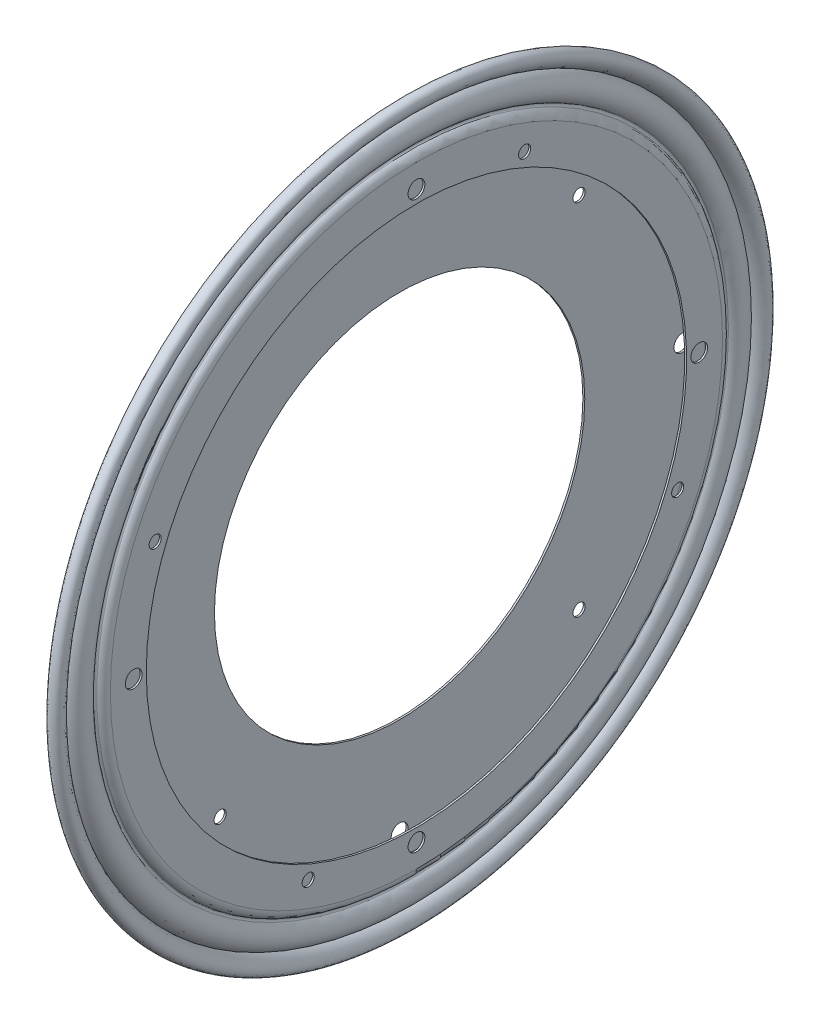
ISO-10303-21;
HEADER;
FILE_DESCRIPTION(('STEP AP214'),'2;1');
FILE_NAME('part.step','',(''),(''),'','','');
FILE_SCHEMA(('AUTOMOTIVE_DESIGN { 1 0 10303 214 1 1 1 1 }'));
ENDSEC;
DATA;
#1=APPLICATION_CONTEXT('core data for automotive mechanical design processes');
#2=APPLICATION_PROTOCOL_DEFINITION('international standard','automotive_design',2000,#1);
#3=PRODUCT_CONTEXT('',#1,'mechanical');
#4=PRODUCT('Part','Part','',(#3));
#5=PRODUCT_RELATED_PRODUCT_CATEGORY('part','',(#4));
#6=PRODUCT_DEFINITION_FORMATION('','',#4);
#7=PRODUCT_DEFINITION_CONTEXT('part definition',#1,'design');
#8=PRODUCT_DEFINITION('design','',#6,#7);
#9=PRODUCT_DEFINITION_SHAPE('','',#8);
#10=(LENGTH_UNIT() NAMED_UNIT(*) SI_UNIT(.MILLI.,.METRE.));
#11=(NAMED_UNIT(*) PLANE_ANGLE_UNIT() SI_UNIT($,.RADIAN.));
#12=(NAMED_UNIT(*) SI_UNIT($,.STERADIAN.) SOLID_ANGLE_UNIT());
#13=UNCERTAINTY_MEASURE_WITH_UNIT(LENGTH_MEASURE(1.E-05),#10,'distance_accuracy_value','');
#14=(GEOMETRIC_REPRESENTATION_CONTEXT(3) GLOBAL_UNCERTAINTY_ASSIGNED_CONTEXT((#13)) GLOBAL_UNIT_ASSIGNED_CONTEXT((#10,
#11,#12)) REPRESENTATION_CONTEXT('',''));
#15=CARTESIAN_POINT('',(0.,0.,0.));
#16=DIRECTION('',(0.,0.,1.));
#17=DIRECTION('',(1.,0.,0.));
#18=AXIS2_PLACEMENT_3D('',#15,#16,#17);
#19=CARTESIAN_POINT('',(-20.7806787586344,-125.372182842589,0.));
#20=DIRECTION('',(1.,0.,0.));
#21=DIRECTION('',(0.,0.,-1.));
#22=AXIS2_PLACEMENT_3D('',#19,#20,#21);
#23=TOROIDAL_SURFACE('',#22,156.907666903698,11.0071865304163);
#24=CARTESIAN_POINT('',(-17.3549548931554,-125.372182842589,0.));
#25=DIRECTION('',(1.,0.,0.));
#26=DIRECTION('',(0.,0.,-1.));
#27=AXIS2_PLACEMENT_3D('',#24,#25,#26);
#28=CIRCLE('',#27,146.447142475503);
#29=CARTESIAN_POINT('',(-17.3549548931554,-125.372182842589,-146.447142475503));
#30=VERTEX_POINT('',#29);
#31=EDGE_CURVE('P0_E11',#30,#30,#28,.T.);
#32=ORIENTED_EDGE('',*,*,#31,.T.);
#33=EDGE_LOOP('',(#32));
#34=FACE_BOUND('',#33,.T.);
#35=CARTESIAN_POINT('',(-17.9016694019906,-125.372182842589,0.));
#36=DIRECTION('',(1.,0.,0.));
#37=DIRECTION('',(0.,0.,-1.));
#38=AXIS2_PLACEMENT_3D('',#35,#36,#37);
#39=CIRCLE('',#38,146.28366292969);
#40=CARTESIAN_POINT('',(-17.9016694019906,-125.372182842589,-146.28366292969));
#41=VERTEX_POINT('',#40);
#42=EDGE_CURVE('P0_E45',#41,#41,#39,.T.);
#43=ORIENTED_EDGE('',*,*,#42,.F.);
#44=EDGE_LOOP('',(#43));
#45=FACE_BOUND('',#44,.T.);
#46=ADVANCED_FACE('P0_F35',(#34,#45),#23,.T.);
#47=CARTESIAN_POINT('',(-17.3549548931554,21.0749596329145,0.));
#48=CARTESIAN_POINT('',(-13.8843389422062,22.21155388043,0.));
#49=CARTESIAN_POINT('',(-13.3298945987826,26.395115924312,0.));
#50=CARTESIAN_POINT('',(-17.2144731093381,27.5448446665488,0.));
#51=CARTESIAN_POINT('',(-17.9016694019901,24.8783484462321,0.));
#52=CARTESIAN_POINT('',(-17.9016694019906,21.801683813341,0.));
#53=B_SPLINE_CURVE_WITH_KNOTS('',3,(#47,#48,#49,#50,#51,#52),.UNSPECIFIED.,.F.,.F.,(4,2,4),(0.,
0.5,1.),.UNSPECIFIED.);
#54=CARTESIAN_POINT('',(-17.9281580617092,-125.372182842589,0.));
#55=DIRECTION('',(1.,0.,0.));
#56=AXIS1_PLACEMENT('',#54,#55);
#57=SURFACE_OF_REVOLUTION('',#53,#56);
#58=CARTESIAN_POINT('',(-17.9016694019906,-125.372182842589,0.));
#59=DIRECTION('',(1.,0.,0.));
#60=DIRECTION('',(0.,0.,-1.));
#61=AXIS2_PLACEMENT_3D('',#58,#59,#60);
#62=CIRCLE('',#61,147.17386665593);
#63=CARTESIAN_POINT('',(-17.9016694019906,-125.372182842589,-147.17386665593));
#64=VERTEX_POINT('',#63);
#65=EDGE_CURVE('P0_E41',#64,#64,#62,.T.);
#66=ORIENTED_EDGE('',*,*,#65,.T.);
#67=EDGE_LOOP('',(#66));
#68=FACE_BOUND('',#67,.T.);
#69=ORIENTED_EDGE('',*,*,#31,.F.);
#70=EDGE_LOOP('',(#69));
#71=FACE_BOUND('',#70,.T.);
#72=ADVANCED_FACE('P0_F57',(#68,#71),#57,.F.);
#73=CARTESIAN_POINT('',(-17.9016694019906,21.8016838133411,0.));
#74=DIRECTION('',(-1.,0.,0.));
#75=DIRECTION('',(0.,0.,1.));
#76=AXIS2_PLACEMENT_3D('',#73,#74,#75);
#77=PLANE('',#76);
#78=ORIENTED_EDGE('',*,*,#42,.T.);
#79=EDGE_LOOP('',(#78));
#80=FACE_BOUND('',#79,.T.);
#81=ORIENTED_EDGE('',*,*,#65,.F.);
#82=EDGE_LOOP('',(#81));
#83=FACE_BOUND('',#82,.T.);
#84=ADVANCED_FACE('P0_F60',(#80,#83),#77,.T.);
#85=CLOSED_SHELL('',(#46,#72,#84));
#86=MANIFOLD_SOLID_BREP('P0_B2',#85);
#87=CARTESIAN_POINT('',(-19.3100196612605,-125.372182842589,0.));
#88=DIRECTION('',(1.,0.,0.));
#89=DIRECTION('',(0.,0.,-1.));
#90=AXIS2_PLACEMENT_3D('',#87,#88,#89);
#91=TOROIDAL_SURFACE('',#90,139.921456642182,6.17720025927117);
#92=CARTESIAN_POINT('',(-17.1079194019906,-125.372182842589,0.));
#93=DIRECTION('',(1.,0.,0.));
#94=DIRECTION('',(0.,1.,0.));
#95=AXIS2_PLACEMENT_3D('',#92,#93,#94);
#96=CIRCLE('',#95,145.692813284364);
#97=CARTESIAN_POINT('',(-17.1079194019906,20.3206304417751,0.));
#98=VERTEX_POINT('',#97);
#99=EDGE_CURVE('P1_E230',#98,#98,#96,.F.);
#100=ORIENTED_EDGE('',*,*,#99,.F.);
#101=EDGE_LOOP('',(#100));
#102=FACE_BOUND('',#101,.T.);
#103=CARTESIAN_POINT('',(-15.4837879251125,-125.372182842589,-4.20150754758772E-13));
#104=DIRECTION('',(1.,0.,0.));
#105=DIRECTION('',(0.,0.,-1.));
#106=AXIS2_PLACEMENT_3D('',#103,#104,#105);
#107=CIRCLE('',#106,135.071945971564);
#108=CARTESIAN_POINT('',(-15.4837879251127,-125.372182842589,-135.071945971565));
#109=VERTEX_POINT('',#108);
#110=EDGE_CURVE('P1_E222',#109,#109,#107,.T.);
#111=ORIENTED_EDGE('',*,*,#110,.F.);
#112=EDGE_LOOP('',(#111));
#113=FACE_BOUND('',#112,.T.);
#114=ADVANCED_FACE('P1_F19',(#102,#113),#91,.T.);
#115=CARTESIAN_POINT('',(-17.1079194019906,20.3206304417751,0.));
#116=CARTESIAN_POINT('',(-13.5609688594263,21.482223370196,0.));
#117=CARTESIAN_POINT('',(-10.2594893705851,27.359305232152,0.));
#118=CARTESIAN_POINT('',(-18.2673052500497,29.8151081640794,0.));
#119=CARTESIAN_POINT('',(-18.8073835861624,24.9252482589153,0.));
#120=CARTESIAN_POINT('',(-18.6954194019905,22.9101467016862,0.));
#121=CARTESIAN_POINT('',(-18.6954194019905,21.801683813341,0.));
#122=(BOUNDED_CURVE() B_SPLINE_CURVE(4,(#115,#116,#117,#118,#119,#120,#121),.UNSPECIFIED.,.F.,
.F.) B_SPLINE_CURVE_WITH_KNOTS((5,1,1,5),(0.,0.579146005992486,0.752139110939153,1.),
.UNSPECIFIED.) CURVE() GEOMETRIC_REPRESENTATION_ITEM() RATIONAL_B_SPLINE_CURVE((1.,1.,1.,1.,1.,
1.,1.)) REPRESENTATION_ITEM(''));
#123=CARTESIAN_POINT('',(-18.6954194019905,-125.372182842589,0.));
#124=DIRECTION('',(1.,0.,0.));
#125=AXIS1_PLACEMENT('',#123,#124);
#126=SURFACE_OF_REVOLUTION('',#122,#125);
#127=ORIENTED_EDGE('',*,*,#99,.T.);
#128=EDGE_LOOP('',(#127));
#129=FACE_BOUND('',#128,.T.);
#130=CARTESIAN_POINT('',(-18.6954194019905,-125.372182842589,0.));
#131=DIRECTION('',(1.,0.,0.));
#132=DIRECTION('',(0.,1.,0.));
#133=AXIS2_PLACEMENT_3D('',#130,#131,#132);
#134=CIRCLE('',#133,147.17386665593);
#135=CARTESIAN_POINT('',(-18.6954194019905,21.801683813341,0.));
#136=VERTEX_POINT('',#135);
#137=EDGE_CURVE('P1_E203',#136,#136,#134,.F.);
#138=ORIENTED_EDGE('',*,*,#137,.F.);
#139=EDGE_LOOP('',(#138));
#140=FACE_BOUND('',#139,.T.);
#141=ADVANCED_FACE('P1_F241',(#129,#140),#126,.F.);
#142=CARTESIAN_POINT('',(-14.9921296797761,-125.372182842589,-3.60822483003176E-13));
#143=DIRECTION('',(1.,0.,0.));
#144=DIRECTION('',(0.,0.,-1.));
#145=AXIS2_PLACEMENT_3D('',#142,#143,#144);
#146=TOROIDAL_SURFACE('',#145,134.448799734881,0.793749999999702);
#147=ORIENTED_EDGE('',*,*,#110,.T.);
#148=EDGE_LOOP('',(#147));
#149=FACE_BOUND('',#148,.T.);
#150=CARTESIAN_POINT('',(-15.344291750717,-125.372182842589,0.));
#151=DIRECTION('',(1.,0.,0.));
#152=DIRECTION('',(0.,0.,-1.));
#153=AXIS2_PLACEMENT_3D('',#150,#151,#152);
#154=CIRCLE('',#153,133.737448247717);
#155=CARTESIAN_POINT('',(-15.344291750717,-125.372182842589,-133.737448247717));
#156=VERTEX_POINT('',#155);
#157=EDGE_CURVE('P1_E200',#156,#156,#154,.T.);
#158=ORIENTED_EDGE('',*,*,#157,.F.);
#159=EDGE_LOOP('',(#158));
#160=FACE_BOUND('',#159,.T.);
#161=ADVANCED_FACE('P1_F245',(#149,#160),#146,.F.);
#162=CARTESIAN_POINT('',(-18.6954194019905,20.6145735626252,0.));
#163=DIRECTION('',(-1.,0.,0.));
#164=DIRECTION('',(0.,0.,1.));
#165=AXIS2_PLACEMENT_3D('',#162,#163,#164);
#166=PLANE('',#165);
#167=CARTESIAN_POINT('',(-18.6954194019905,-125.372182842589,0.));
#168=DIRECTION('',(1.,0.,0.));
#169=DIRECTION('',(0.,0.,-1.));
#170=AXIS2_PLACEMENT_3D('',#167,#168,#169);
#171=CIRCLE('',#170,144.799646154499);
#172=CARTESIAN_POINT('',(-18.6954194019905,-125.372182842589,-144.799646154499));
#173=VERTEX_POINT('',#172);
#174=EDGE_CURVE('P1_E23',#173,#173,#171,.F.);
#175=ORIENTED_EDGE('',*,*,#174,.F.);
#176=EDGE_LOOP('',(#175));
#177=FACE_BOUND('',#176,.T.);
#178=ORIENTED_EDGE('',*,*,#137,.T.);
#179=EDGE_LOOP('',(#178));
#180=FACE_BOUND('',#179,.T.);
#181=ADVANCED_FACE('P1_F193',(#177,#180),#166,.T.);
#182=CARTESIAN_POINT('',(-17.1079194019905,-125.372182842589,0.));
#183=DIRECTION('',(1.,0.,0.));
#184=DIRECTION('',(0.,0.,-1.));
#185=AXIS2_PLACEMENT_3D('',#182,#183,#184);
#186=TOROIDAL_SURFACE('',#185,130.175,3.9751);
#187=ORIENTED_EDGE('',*,*,#157,.T.);
#188=EDGE_LOOP('',(#187));
#189=FACE_BOUND('',#188,.T.);
#190=CARTESIAN_POINT('',(-13.1328194019905,-125.372182842589,0.));
#191=DIRECTION('',(-1.,0.,0.));
#192=DIRECTION('',(0.,1.,0.));
#193=AXIS2_PLACEMENT_3D('',#190,#191,#192);
#194=CIRCLE('',#193,130.175);
#195=CARTESIAN_POINT('',(-13.1328194019905,4.80281715741121,0.));
#196=VERTEX_POINT('',#195);
#197=EDGE_CURVE('P1_E149',#196,#196,#194,.F.);
#198=ORIENTED_EDGE('',*,*,#197,.F.);
#199=EDGE_LOOP('',(#198));
#200=FACE_BOUND('',#199,.T.);
#201=ADVANCED_FACE('P1_F188',(#189,#200),#186,.T.);
#202=CARTESIAN_POINT('',(-14.9058191427206,-125.372182842589,0.));
#203=DIRECTION('',(1.,0.,0.));
#204=DIRECTION('',(0.,0.,-1.));
#205=AXIS2_PLACEMENT_3D('',#202,#203,#204);
#206=TOROIDAL_SURFACE('',#205,139.921456642182,6.17720025927117);
#207=CARTESIAN_POINT('',(-18.7320508788683,-125.372182842589,-7.98234008933115E-13));
#208=DIRECTION('',(-1.,0.,0.));
#209=DIRECTION('',(0.,0.,1.));
#210=AXIS2_PLACEMENT_3D('',#207,#208,#209);
#211=CIRCLE('',#210,135.071945971565);
#212=CARTESIAN_POINT('',(-18.7320508788681,-125.372182842589,135.071945971564));
#213=VERTEX_POINT('',#212);
#214=EDGE_CURVE('P1_E145',#213,#213,#211,.T.);
#215=ORIENTED_EDGE('',*,*,#214,.F.);
#216=EDGE_LOOP('',(#215));
#217=FACE_BOUND('',#216,.T.);
#218=ORIENTED_EDGE('',*,*,#174,.T.);
#219=EDGE_LOOP('',(#218));
#220=FACE_BOUND('',#219,.T.);
#221=ADVANCED_FACE('P1_F182',(#217,#220),#206,.T.);
#222=CARTESIAN_POINT('',(-13.1328194019906,-60.2846828425888,0.));
#223=DIRECTION('',(1.,0.,0.));
#224=DIRECTION('',(0.,0.,-1.));
#225=AXIS2_PLACEMENT_3D('',#222,#223,#224);
#226=PLANE('',#225);
#227=CARTESIAN_POINT('',(-13.1328194019906,-125.372182842589,0.));
#228=DIRECTION('',(-1.,0.,0.));
#229=DIRECTION('',(0.,0.,1.));
#230=AXIS2_PLACEMENT_3D('',#227,#228,#229);
#231=CIRCLE('',#230,114.8969);
#232=CARTESIAN_POINT('',(-13.1328194019906,-125.372182842589,114.8969));
#233=VERTEX_POINT('',#232);
#234=EDGE_CURVE('P1_E120',#233,#233,#231,.T.);
#235=ORIENTED_EDGE('',*,*,#234,.T.);
#236=EDGE_LOOP('',(#235));
#237=FACE_BOUND('',#236,.T.);
#238=CARTESIAN_POINT('',(-13.1328194019906,-5.11588284258878,0.));
#239=DIRECTION('',(1.,0.,0.));
#240=DIRECTION('',(0.,0.,-1.));
#241=AXIS2_PLACEMENT_3D('',#238,#239,#240);
#242=CIRCLE('',#241,3.5687);
#243=CARTESIAN_POINT('',(-13.1328194019906,-5.11588284258878,-3.5687));
#244=VERTEX_POINT('',#243);
#245=EDGE_CURVE('P1_E123',#244,#244,#242,.F.);
#246=ORIENTED_EDGE('',*,*,#245,.T.);
#247=EDGE_LOOP('',(#246));
#248=FACE_BOUND('',#247,.T.);
#249=CARTESIAN_POINT('',(-13.1328194019906,-125.372182842589,-120.2563));
#250=DIRECTION('',(1.,0.,0.));
#251=DIRECTION('',(0.,0.,-1.));
#252=AXIS2_PLACEMENT_3D('',#249,#250,#251);
#253=CIRCLE('',#252,3.56869999999997);
#254=CARTESIAN_POINT('',(-13.1328194019906,-125.372182842589,-123.825));
#255=VERTEX_POINT('',#254);
#256=EDGE_CURVE('P1_E126',#255,#255,#253,.F.);
#257=ORIENTED_EDGE('',*,*,#256,.T.);
#258=EDGE_LOOP('',(#257));
#259=FACE_BOUND('',#258,.T.);
#260=CARTESIAN_POINT('',(-13.1328194019906,-245.628482842589,0.));
#261=DIRECTION('',(1.,0.,0.));
#262=DIRECTION('',(0.,0.,-1.));
#263=AXIS2_PLACEMENT_3D('',#260,#261,#262);
#264=CIRCLE('',#263,3.56870000000005);
#265=CARTESIAN_POINT('',(-13.1328194019906,-245.628482842589,-3.5687));
#266=VERTEX_POINT('',#265);
#267=EDGE_CURVE('P1_E129',#266,#266,#264,.F.);
#268=ORIENTED_EDGE('',*,*,#267,.T.);
#269=EDGE_LOOP('',(#268));
#270=FACE_BOUND('',#269,.T.);
#271=CARTESIAN_POINT('',(-13.1328194019906,-125.372182842589,120.2563));
#272=DIRECTION('',(1.,0.,0.));
#273=DIRECTION('',(0.,0.,-1.));
#274=AXIS2_PLACEMENT_3D('',#271,#272,#273);
#275=CIRCLE('',#274,3.56869999999992);
#276=CARTESIAN_POINT('',(-13.1328194019906,-125.372182842589,116.6876));
#277=VERTEX_POINT('',#276);
#278=EDGE_CURVE('P1_E132',#277,#277,#275,.F.);
#279=ORIENTED_EDGE('',*,*,#278,.T.);
#280=EDGE_LOOP('',(#279));
#281=FACE_BOUND('',#280,.T.);
#282=CARTESIAN_POINT('',(-13.1328194019906,-14.2698486170517,-46.0200936475259));
#283=DIRECTION('',(1.,0.,0.));
#284=DIRECTION('',(0.,0.,-1.));
#285=AXIS2_PLACEMENT_3D('',#282,#283,#284);
#286=CIRCLE('',#285,2.57809999999995);
#287=CARTESIAN_POINT('',(-13.1328194019906,-14.2698486170517,-48.5981936475259));
#288=VERTEX_POINT('',#287);
#289=EDGE_CURVE('P1_E135',#288,#288,#286,.F.);
#290=ORIENTED_EDGE('',*,*,#289,.T.);
#291=EDGE_LOOP('',(#290));
#292=FACE_BOUND('',#291,.T.);
#293=CARTESIAN_POINT('',(-13.1328194019906,-171.392276490115,-111.102334225537));
#294=DIRECTION('',(1.,0.,0.));
#295=DIRECTION('',(0.,0.,-1.));
#296=AXIS2_PLACEMENT_3D('',#293,#294,#295);
#297=CIRCLE('',#296,2.5781);
#298=CARTESIAN_POINT('',(-13.1328194019906,-171.392276490115,-113.680434225537));
#299=VERTEX_POINT('',#298);
#300=EDGE_CURVE('P1_E138',#299,#299,#297,.F.);
#301=ORIENTED_EDGE('',*,*,#300,.T.);
#302=EDGE_LOOP('',(#301));
#303=FACE_BOUND('',#302,.T.);
#304=CARTESIAN_POINT('',(-13.1328194019906,-236.474517068126,46.0200936475259));
#305=DIRECTION('',(1.,0.,0.));
#306=DIRECTION('',(0.,0.,-1.));
#307=AXIS2_PLACEMENT_3D('',#304,#305,#306);
#308=CIRCLE('',#307,2.57809999999995);
#309=CARTESIAN_POINT('',(-13.1328194019906,-236.474517068126,43.441993647526));
#310=VERTEX_POINT('',#309);
#311=EDGE_CURVE('P1_E141',#310,#310,#308,.F.);
#312=ORIENTED_EDGE('',*,*,#311,.T.);
#313=EDGE_LOOP('',(#312));
#314=FACE_BOUND('',#313,.T.);
#315=CARTESIAN_POINT('',(-13.1328194019906,-79.3520891950629,111.102334225537));
#316=DIRECTION('',(1.,0.,0.));
#317=DIRECTION('',(0.,0.,-1.));
#318=AXIS2_PLACEMENT_3D('',#315,#316,#317);
#319=CIRCLE('',#318,2.57810000000005);
#320=CARTESIAN_POINT('',(-13.1328194019906,-79.3520891950629,108.524234225537));
#321=VERTEX_POINT('',#320);
#322=EDGE_CURVE('P1_E143',#321,#321,#319,.F.);
#323=ORIENTED_EDGE('',*,*,#322,.T.);
#324=EDGE_LOOP('',(#323));
#325=FACE_BOUND('',#324,.T.);
#326=ORIENTED_EDGE('',*,*,#197,.T.);
#327=EDGE_LOOP('',(#326));
#328=FACE_BOUND('',#327,.T.);
#329=ADVANCED_FACE('P1_F171',(#237,#248,#259,#270,#281,#292,#303,#314,#325,#328),#226,.T.);
#330=CARTESIAN_POINT('',(-19.2237091242057,-125.372182842589,-8.04911692853238E-13));
#331=DIRECTION('',(1.,0.,0.));
#332=DIRECTION('',(0.,0.,-1.));
#333=AXIS2_PLACEMENT_3D('',#330,#331,#332);
#334=TOROIDAL_SURFACE('',#333,134.448799734881,0.793750000000423);
#335=CARTESIAN_POINT('',(-18.8715470532641,-125.372182842589,0.));
#336=DIRECTION('',(1.,0.,0.));
#337=DIRECTION('',(0.,0.,-1.));
#338=AXIS2_PLACEMENT_3D('',#335,#336,#337);
#339=CIRCLE('',#338,133.737448247717);
#340=CARTESIAN_POINT('',(-18.8715470532641,-125.372182842589,-133.737448247717));
#341=VERTEX_POINT('',#340);
#342=EDGE_CURVE('P1_E119',#341,#341,#339,.F.);
#343=ORIENTED_EDGE('',*,*,#342,.F.);
#344=EDGE_LOOP('',(#343));
#345=FACE_BOUND('',#344,.T.);
#346=ORIENTED_EDGE('',*,*,#214,.T.);
#347=EDGE_LOOP('',(#346));
#348=FACE_BOUND('',#347,.T.);
#349=ADVANCED_FACE('P1_F181',(#345,#348),#334,.F.);
#350=CARTESIAN_POINT('',(-13.5296944019906,-79.3520891950629,111.102334225537));
#351=DIRECTION('',(1.,0.,0.));
#352=DIRECTION('',(0.,0.,-1.));
#353=AXIS2_PLACEMENT_3D('',#350,#351,#352);
#354=CYLINDRICAL_SURFACE('',#353,2.57810000000005);
#355=CARTESIAN_POINT('',(-13.9265694019906,-79.3520891950629,111.102334225537));
#356=DIRECTION('',(1.,0.,0.));
#357=DIRECTION('',(0.,0.,-1.));
#358=AXIS2_PLACEMENT_3D('',#355,#356,#357);
#359=CIRCLE('',#358,2.57810000000005);
#360=CARTESIAN_POINT('',(-13.9265694019906,-79.3520891950629,108.524234225537));
#361=VERTEX_POINT('',#360);
#362=EDGE_CURVE('P1_E116',#361,#361,#359,.T.);
#363=ORIENTED_EDGE('',*,*,#362,.F.);
#364=EDGE_LOOP('',(#363));
#365=FACE_BOUND('',#364,.T.);
#366=ORIENTED_EDGE('',*,*,#322,.F.);
#367=EDGE_LOOP('',(#366));
#368=FACE_BOUND('',#367,.T.);
#369=ADVANCED_FACE('P1_F184',(#365,#368),#354,.F.);
#370=CARTESIAN_POINT('',(-13.5296944019906,-236.474517068126,46.0200936475259));
#371=DIRECTION('',(1.,0.,0.));
#372=DIRECTION('',(0.,0.,-1.));
#373=AXIS2_PLACEMENT_3D('',#370,#371,#372);
#374=CYLINDRICAL_SURFACE('',#373,2.57809999999995);
#375=CARTESIAN_POINT('',(-13.9265694019906,-236.474517068126,46.0200936475259));
#376=DIRECTION('',(1.,0.,0.));
#377=DIRECTION('',(0.,0.,-1.));
#378=AXIS2_PLACEMENT_3D('',#375,#376,#377);
#379=CIRCLE('',#378,2.57809999999995);
#380=CARTESIAN_POINT('',(-13.9265694019906,-236.474517068126,43.441993647526));
#381=VERTEX_POINT('',#380);
#382=EDGE_CURVE('P1_E113',#381,#381,#379,.T.);
#383=ORIENTED_EDGE('',*,*,#382,.F.);
#384=EDGE_LOOP('',(#383));
#385=FACE_BOUND('',#384,.T.);
#386=ORIENTED_EDGE('',*,*,#311,.F.);
#387=EDGE_LOOP('',(#386));
#388=FACE_BOUND('',#387,.T.);
#389=ADVANCED_FACE('P1_F266',(#385,#388),#374,.F.);
#390=CARTESIAN_POINT('',(-13.5296944019906,-171.392276490115,-111.102334225537));
#391=DIRECTION('',(1.,0.,0.));
#392=DIRECTION('',(0.,0.,-1.));
#393=AXIS2_PLACEMENT_3D('',#390,#391,#392);
#394=CYLINDRICAL_SURFACE('',#393,2.5781);
#395=CARTESIAN_POINT('',(-13.9265694019906,-171.392276490115,-111.102334225537));
#396=DIRECTION('',(1.,0.,0.));
#397=DIRECTION('',(0.,0.,-1.));
#398=AXIS2_PLACEMENT_3D('',#395,#396,#397);
#399=CIRCLE('',#398,2.5781);
#400=CARTESIAN_POINT('',(-13.9265694019906,-171.392276490115,-113.680434225537));
#401=VERTEX_POINT('',#400);
#402=EDGE_CURVE('P1_E110',#401,#401,#399,.T.);
#403=ORIENTED_EDGE('',*,*,#402,.F.);
#404=EDGE_LOOP('',(#403));
#405=FACE_BOUND('',#404,.T.);
#406=ORIENTED_EDGE('',*,*,#300,.F.);
#407=EDGE_LOOP('',(#406));
#408=FACE_BOUND('',#407,.T.);
#409=ADVANCED_FACE('P1_F360',(#405,#408),#394,.F.);
#410=CARTESIAN_POINT('',(-13.5296944019906,-14.2698486170517,-46.0200936475259));
#411=DIRECTION('',(1.,0.,0.));
#412=DIRECTION('',(0.,0.,-1.));
#413=AXIS2_PLACEMENT_3D('',#410,#411,#412);
#414=CYLINDRICAL_SURFACE('',#413,2.57809999999995);
#415=CARTESIAN_POINT('',(-13.9265694019906,-14.2698486170517,-46.0200936475259));
#416=DIRECTION('',(1.,0.,0.));
#417=DIRECTION('',(0.,0.,-1.));
#418=AXIS2_PLACEMENT_3D('',#415,#416,#417);
#419=CIRCLE('',#418,2.57809999999995);
#420=CARTESIAN_POINT('',(-13.9265694019906,-14.2698486170517,-48.5981936475259));
#421=VERTEX_POINT('',#420);
#422=EDGE_CURVE('P1_E107',#421,#421,#419,.T.);
#423=ORIENTED_EDGE('',*,*,#422,.F.);
#424=EDGE_LOOP('',(#423));
#425=FACE_BOUND('',#424,.T.);
#426=ORIENTED_EDGE('',*,*,#289,.F.);
#427=EDGE_LOOP('',(#426));
#428=FACE_BOUND('',#427,.T.);
#429=ADVANCED_FACE('P1_F356',(#425,#428),#414,.F.);
#430=CARTESIAN_POINT('',(-13.5296944019906,-125.372182842589,120.2563));
#431=DIRECTION('',(1.,0.,0.));
#432=DIRECTION('',(0.,0.,-1.));
#433=AXIS2_PLACEMENT_3D('',#430,#431,#432);
#434=CYLINDRICAL_SURFACE('',#433,3.56869999999992);
#435=CARTESIAN_POINT('',(-13.9265694019906,-125.372182842589,120.2563));
#436=DIRECTION('',(1.,0.,0.));
#437=DIRECTION('',(0.,0.,-1.));
#438=AXIS2_PLACEMENT_3D('',#435,#436,#437);
#439=CIRCLE('',#438,3.56869999999992);
#440=CARTESIAN_POINT('',(-13.9265694019906,-125.372182842589,116.6876));
#441=VERTEX_POINT('',#440);
#442=EDGE_CURVE('P1_E104',#441,#441,#439,.T.);
#443=ORIENTED_EDGE('',*,*,#442,.F.);
#444=EDGE_LOOP('',(#443));
#445=FACE_BOUND('',#444,.T.);
#446=ORIENTED_EDGE('',*,*,#278,.F.);
#447=EDGE_LOOP('',(#446));
#448=FACE_BOUND('',#447,.T.);
#449=ADVANCED_FACE('P1_F352',(#445,#448),#434,.F.);
#450=CARTESIAN_POINT('',(-13.5296944019906,-245.628482842589,0.));
#451=DIRECTION('',(1.,0.,0.));
#452=DIRECTION('',(0.,0.,-1.));
#453=AXIS2_PLACEMENT_3D('',#450,#451,#452);
#454=CYLINDRICAL_SURFACE('',#453,3.56870000000005);
#455=CARTESIAN_POINT('',(-13.9265694019906,-245.628482842589,0.));
#456=DIRECTION('',(1.,0.,0.));
#457=DIRECTION('',(0.,0.,-1.));
#458=AXIS2_PLACEMENT_3D('',#455,#456,#457);
#459=CIRCLE('',#458,3.56870000000005);
#460=CARTESIAN_POINT('',(-13.9265694019906,-245.628482842589,-3.5687));
#461=VERTEX_POINT('',#460);
#462=EDGE_CURVE('P1_E101',#461,#461,#459,.T.);
#463=ORIENTED_EDGE('',*,*,#462,.F.);
#464=EDGE_LOOP('',(#463));
#465=FACE_BOUND('',#464,.T.);
#466=ORIENTED_EDGE('',*,*,#267,.F.);
#467=EDGE_LOOP('',(#466));
#468=FACE_BOUND('',#467,.T.);
#469=ADVANCED_FACE('P1_F348',(#465,#468),#454,.F.);
#470=CARTESIAN_POINT('',(-13.5296944019906,-125.372182842589,-120.2563));
#471=DIRECTION('',(1.,0.,0.));
#472=DIRECTION('',(0.,0.,-1.));
#473=AXIS2_PLACEMENT_3D('',#470,#471,#472);
#474=CYLINDRICAL_SURFACE('',#473,3.56869999999997);
#475=CARTESIAN_POINT('',(-13.9265694019906,-125.372182842589,-120.2563));
#476=DIRECTION('',(1.,0.,0.));
#477=DIRECTION('',(0.,0.,-1.));
#478=AXIS2_PLACEMENT_3D('',#475,#476,#477);
#479=CIRCLE('',#478,3.56869999999997);
#480=CARTESIAN_POINT('',(-13.9265694019906,-125.372182842589,-123.825));
#481=VERTEX_POINT('',#480);
#482=EDGE_CURVE('P1_E98',#481,#481,#479,.T.);
#483=ORIENTED_EDGE('',*,*,#482,.F.);
#484=EDGE_LOOP('',(#483));
#485=FACE_BOUND('',#484,.T.);
#486=ORIENTED_EDGE('',*,*,#256,.F.);
#487=EDGE_LOOP('',(#486));
#488=FACE_BOUND('',#487,.T.);
#489=ADVANCED_FACE('P1_F344',(#485,#488),#474,.F.);
#490=CARTESIAN_POINT('',(-13.5296944019906,-5.11588284258878,0.));
#491=DIRECTION('',(1.,0.,0.));
#492=DIRECTION('',(0.,0.,-1.));
#493=AXIS2_PLACEMENT_3D('',#490,#491,#492);
#494=CYLINDRICAL_SURFACE('',#493,3.5687);
#495=CARTESIAN_POINT('',(-13.9265694019906,-5.11588284258878,0.));
#496=DIRECTION('',(1.,0.,0.));
#497=DIRECTION('',(0.,0.,-1.));
#498=AXIS2_PLACEMENT_3D('',#495,#496,#497);
#499=CIRCLE('',#498,3.5687);
#500=CARTESIAN_POINT('',(-13.9265694019906,-5.11588284258878,-3.5687));
#501=VERTEX_POINT('',#500);
#502=EDGE_CURVE('P1_E95',#501,#501,#499,.T.);
#503=ORIENTED_EDGE('',*,*,#502,.F.);
#504=EDGE_LOOP('',(#503));
#505=FACE_BOUND('',#504,.T.);
#506=ORIENTED_EDGE('',*,*,#245,.F.);
#507=EDGE_LOOP('',(#506));
#508=FACE_BOUND('',#507,.T.);
#509=ADVANCED_FACE('P1_F340',(#505,#508),#494,.F.);
#510=CARTESIAN_POINT('',(-13.1328194019906,-125.372182842589,0.));
#511=DIRECTION('',(-1.,0.,0.));
#512=DIRECTION('',(0.,0.,1.));
#513=AXIS2_PLACEMENT_3D('',#510,#511,#512);
#514=CYLINDRICAL_SURFACE('',#513,114.8969);
#515=CARTESIAN_POINT('',(-13.9265694019906,-125.372182842589,0.));
#516=DIRECTION('',(-1.,0.,0.));
#517=DIRECTION('',(0.,0.,1.));
#518=AXIS2_PLACEMENT_3D('',#515,#516,#517);
#519=CIRCLE('',#518,114.8969);
#520=CARTESIAN_POINT('',(-13.9265694019906,-125.372182842589,114.8969));
#521=VERTEX_POINT('',#520);
#522=EDGE_CURVE('P1_E92',#521,#521,#519,.F.);
#523=ORIENTED_EDGE('',*,*,#522,.F.);
#524=EDGE_LOOP('',(#523));
#525=FACE_BOUND('',#524,.T.);
#526=ORIENTED_EDGE('',*,*,#234,.F.);
#527=EDGE_LOOP('',(#526));
#528=FACE_BOUND('',#527,.T.);
#529=ADVANCED_FACE('P1_F336',(#525,#528),#514,.F.);
#530=CARTESIAN_POINT('',(-17.1079194019905,-125.372182842589,0.));
#531=DIRECTION('',(1.,0.,0.));
#532=DIRECTION('',(0.,0.,-1.));
#533=AXIS2_PLACEMENT_3D('',#530,#531,#532);
#534=TOROIDAL_SURFACE('',#533,130.175,3.97509999999998);
#535=CARTESIAN_POINT('',(-21.0830194019905,-125.372182842589,0.));
#536=DIRECTION('',(1.,0.,0.));
#537=DIRECTION('',(0.,1.,0.));
#538=AXIS2_PLACEMENT_3D('',#535,#536,#537);
#539=CIRCLE('',#538,130.175);
#540=CARTESIAN_POINT('',(-21.0830194019905,4.80281715741121,0.));
#541=VERTEX_POINT('',#540);
#542=EDGE_CURVE('P1_E91',#541,#541,#539,.F.);
#543=ORIENTED_EDGE('',*,*,#542,.F.);
#544=EDGE_LOOP('',(#543));
#545=FACE_BOUND('',#544,.T.);
#546=ORIENTED_EDGE('',*,*,#342,.T.);
#547=EDGE_LOOP('',(#546));
#548=FACE_BOUND('',#547,.T.);
#549=ADVANCED_FACE('P1_F332',(#545,#548),#534,.T.);
#550=CARTESIAN_POINT('',(-13.9265694019906,-60.2846828425888,0.));
#551=DIRECTION('',(-1.,0.,0.));
#552=DIRECTION('',(0.,0.,1.));
#553=AXIS2_PLACEMENT_3D('',#550,#551,#552);
#554=PLANE('',#553);
#555=ORIENTED_EDGE('',*,*,#522,.T.);
#556=EDGE_LOOP('',(#555));
#557=FACE_BOUND('',#556,.T.);
#558=ORIENTED_EDGE('',*,*,#502,.T.);
#559=EDGE_LOOP('',(#558));
#560=FACE_BOUND('',#559,.T.);
#561=ORIENTED_EDGE('',*,*,#482,.T.);
#562=EDGE_LOOP('',(#561));
#563=FACE_BOUND('',#562,.T.);
#564=ORIENTED_EDGE('',*,*,#462,.T.);
#565=EDGE_LOOP('',(#564));
#566=FACE_BOUND('',#565,.T.);
#567=ORIENTED_EDGE('',*,*,#442,.T.);
#568=EDGE_LOOP('',(#567));
#569=FACE_BOUND('',#568,.T.);
#570=ORIENTED_EDGE('',*,*,#422,.T.);
#571=EDGE_LOOP('',(#570));
#572=FACE_BOUND('',#571,.T.);
#573=ORIENTED_EDGE('',*,*,#402,.T.);
#574=EDGE_LOOP('',(#573));
#575=FACE_BOUND('',#574,.T.);
#576=ORIENTED_EDGE('',*,*,#382,.T.);
#577=EDGE_LOOP('',(#576));
#578=FACE_BOUND('',#577,.T.);
#579=ORIENTED_EDGE('',*,*,#362,.T.);
#580=EDGE_LOOP('',(#579));
#581=FACE_BOUND('',#580,.T.);
#582=CARTESIAN_POINT('',(-13.9265694019906,-125.372182842589,0.));
#583=DIRECTION('',(1.,0.,0.));
#584=DIRECTION('',(0.,0.,-1.));
#585=AXIS2_PLACEMENT_3D('',#582,#583,#584);
#586=CIRCLE('',#585,130.175);
#587=CARTESIAN_POINT('',(-13.9265694019903,-125.372182842589,-130.175));
#588=VERTEX_POINT('',#587);
#589=EDGE_CURVE('P1_E88',#588,#588,#586,.T.);
#590=ORIENTED_EDGE('',*,*,#589,.F.);
#591=EDGE_LOOP('',(#590));
#592=FACE_BOUND('',#591,.T.);
#593=ADVANCED_FACE('P1_F316',(#557,#560,#563,#566,#569,#572,#575,#578,#581,#592),#554,.T.);
#594=CARTESIAN_POINT('',(-21.0830194019906,-60.2846828425888,0.));
#595=DIRECTION('',(-1.,0.,0.));
#596=DIRECTION('',(0.,0.,1.));
#597=AXIS2_PLACEMENT_3D('',#594,#595,#596);
#598=PLANE('',#597);
#599=CARTESIAN_POINT('',(-21.0830194019906,-49.0400058135011,76.3321770290878));
#600=DIRECTION('',(1.,0.,0.));
#601=DIRECTION('',(0.,0.,-1.));
#602=AXIS2_PLACEMENT_3D('',#599,#600,#601);
#603=CIRCLE('',#602,2.5781);
#604=CARTESIAN_POINT('',(-21.0830194019906,-49.0400058135011,73.7540770290878));
#605=VERTEX_POINT('',#604);
#606=EDGE_CURVE('P1_E61',#605,#605,#603,.T.);
#607=ORIENTED_EDGE('',*,*,#606,.T.);
#608=EDGE_LOOP('',(#607));
#609=FACE_BOUND('',#608,.T.);
#610=CARTESIAN_POINT('',(-21.0830194019906,-201.704359871677,76.3321770290878));
#611=DIRECTION('',(1.,0.,0.));
#612=DIRECTION('',(0.,0.,-1.));
#613=AXIS2_PLACEMENT_3D('',#610,#611,#612);
#614=CIRCLE('',#613,2.5781);
#615=CARTESIAN_POINT('',(-21.0830194019906,-201.704359871677,73.7540770290878));
#616=VERTEX_POINT('',#615);
#617=EDGE_CURVE('P1_E64',#616,#616,#614,.T.);
#618=ORIENTED_EDGE('',*,*,#617,.T.);
#619=EDGE_LOOP('',(#618));
#620=FACE_BOUND('',#619,.T.);
#621=CARTESIAN_POINT('',(-21.0830194019906,-201.704359871677,-76.3321770290879));
#622=DIRECTION('',(1.,0.,0.));
#623=DIRECTION('',(0.,0.,-1.));
#624=AXIS2_PLACEMENT_3D('',#621,#622,#623);
#625=CIRCLE('',#624,2.5781);
#626=CARTESIAN_POINT('',(-21.0830194019906,-201.704359871677,-78.9102770290879));
#627=VERTEX_POINT('',#626);
#628=EDGE_CURVE('P1_E67',#627,#627,#625,.T.);
#629=ORIENTED_EDGE('',*,*,#628,.T.);
#630=EDGE_LOOP('',(#629));
#631=FACE_BOUND('',#630,.T.);
#632=CARTESIAN_POINT('',(-21.0830194019906,-49.040005813501,-76.3321770290878));
#633=DIRECTION('',(1.,0.,0.));
#634=DIRECTION('',(0.,0.,-1.));
#635=AXIS2_PLACEMENT_3D('',#632,#633,#634);
#636=CIRCLE('',#635,2.5781);
#637=CARTESIAN_POINT('',(-21.0830194019906,-49.040005813501,-78.9102770290878));
#638=VERTEX_POINT('',#637);
#639=EDGE_CURVE('P1_E70',#638,#638,#636,.T.);
#640=ORIENTED_EDGE('',*,*,#639,.T.);
#641=EDGE_LOOP('',(#640));
#642=FACE_BOUND('',#641,.T.);
#643=CARTESIAN_POINT('',(-21.0830194019906,-125.372182842589,120.2563));
#644=DIRECTION('',(1.,0.,0.));
#645=DIRECTION('',(0.,0.,-1.));
#646=AXIS2_PLACEMENT_3D('',#643,#644,#645);
#647=CIRCLE('',#646,3.56869999999992);
#648=CARTESIAN_POINT('',(-21.0830194019906,-125.372182842589,116.6876));
#649=VERTEX_POINT('',#648);
#650=EDGE_CURVE('P1_E73',#649,#649,#647,.T.);
#651=ORIENTED_EDGE('',*,*,#650,.T.);
#652=EDGE_LOOP('',(#651));
#653=FACE_BOUND('',#652,.T.);
#654=CARTESIAN_POINT('',(-21.0830194019906,-245.628482842589,0.));
#655=DIRECTION('',(1.,0.,0.));
#656=DIRECTION('',(0.,0.,-1.));
#657=AXIS2_PLACEMENT_3D('',#654,#655,#656);
#658=CIRCLE('',#657,3.56870000000005);
#659=CARTESIAN_POINT('',(-21.0830194019906,-245.628482842589,-3.5687));
#660=VERTEX_POINT('',#659);
#661=EDGE_CURVE('P1_E76',#660,#660,#658,.T.);
#662=ORIENTED_EDGE('',*,*,#661,.T.);
#663=EDGE_LOOP('',(#662));
#664=FACE_BOUND('',#663,.T.);
#665=CARTESIAN_POINT('',(-21.0830194019906,-125.372182842589,-120.2563));
#666=DIRECTION('',(1.,0.,0.));
#667=DIRECTION('',(0.,0.,-1.));
#668=AXIS2_PLACEMENT_3D('',#665,#666,#667);
#669=CIRCLE('',#668,3.56869999999997);
#670=CARTESIAN_POINT('',(-21.0830194019906,-125.372182842589,-123.825));
#671=VERTEX_POINT('',#670);
#672=EDGE_CURVE('P1_E79',#671,#671,#669,.T.);
#673=ORIENTED_EDGE('',*,*,#672,.T.);
#674=EDGE_LOOP('',(#673));
#675=FACE_BOUND('',#674,.T.);
#676=CARTESIAN_POINT('',(-21.0830194019906,-5.11588284258878,0.));
#677=DIRECTION('',(1.,0.,0.));
#678=DIRECTION('',(0.,0.,-1.));
#679=AXIS2_PLACEMENT_3D('',#676,#677,#678);
#680=CIRCLE('',#679,3.5687);
#681=CARTESIAN_POINT('',(-21.0830194019906,-5.11588284258878,-3.5687));
#682=VERTEX_POINT('',#681);
#683=EDGE_CURVE('P1_E82',#682,#682,#680,.T.);
#684=ORIENTED_EDGE('',*,*,#683,.T.);
#685=EDGE_LOOP('',(#684));
#686=FACE_BOUND('',#685,.T.);
#687=CARTESIAN_POINT('',(-21.0830194019906,-125.372182842589,0.));
#688=DIRECTION('',(-1.,0.,0.));
#689=DIRECTION('',(0.,0.,1.));
#690=AXIS2_PLACEMENT_3D('',#687,#688,#689);
#691=CIRCLE('',#690,78.7527);
#692=CARTESIAN_POINT('',(-21.0830194019906,-125.372182842589,78.7527));
#693=VERTEX_POINT('',#692);
#694=EDGE_CURVE('P1_E85',#693,#693,#691,.F.);
#695=ORIENTED_EDGE('',*,*,#694,.T.);
#696=EDGE_LOOP('',(#695));
#697=FACE_BOUND('',#696,.T.);
#698=ORIENTED_EDGE('',*,*,#542,.T.);
#699=EDGE_LOOP('',(#698));
#700=FACE_BOUND('',#699,.T.);
#701=ADVANCED_FACE('P1_F312',(#609,#620,#631,#642,#653,#664,#675,#686,#697,#700),#598,.T.);
#702=CARTESIAN_POINT('',(-17.1079194019905,-125.372182842589,0.));
#703=DIRECTION('',(1.,0.,0.));
#704=DIRECTION('',(0.,0.,-1.));
#705=AXIS2_PLACEMENT_3D('',#702,#703,#704);
#706=TOROIDAL_SURFACE('',#705,130.175,3.18134999999992);
#707=ORIENTED_EDGE('',*,*,#589,.T.);
#708=EDGE_LOOP('',(#707));
#709=FACE_BOUND('',#708,.T.);
#710=CARTESIAN_POINT('',(-20.2892694019904,-125.372182842589,0.));
#711=DIRECTION('',(1.,0.,0.));
#712=DIRECTION('',(0.,0.,-1.));
#713=AXIS2_PLACEMENT_3D('',#710,#711,#712);
#714=CIRCLE('',#713,130.175);
#715=CARTESIAN_POINT('',(-20.2892694019902,-125.372182842589,-130.175));
#716=VERTEX_POINT('',#715);
#717=EDGE_CURVE('P1_E58',#716,#716,#714,.T.);
#718=ORIENTED_EDGE('',*,*,#717,.F.);
#719=EDGE_LOOP('',(#718));
#720=FACE_BOUND('',#719,.T.);
#721=ADVANCED_FACE('P1_F21',(#709,#720),#706,.F.);
#722=CARTESIAN_POINT('',(-20.2892694019906,-125.372182842589,0.));
#723=DIRECTION('',(-1.,0.,0.));
#724=DIRECTION('',(0.,0.,1.));
#725=AXIS2_PLACEMENT_3D('',#722,#723,#724);
#726=CYLINDRICAL_SURFACE('',#725,78.7527);
#727=CARTESIAN_POINT('',(-20.2892694019906,-125.372182842589,0.));
#728=DIRECTION('',(-1.,0.,0.));
#729=DIRECTION('',(0.,0.,1.));
#730=AXIS2_PLACEMENT_3D('',#727,#728,#729);
#731=CIRCLE('',#730,78.7527);
#732=CARTESIAN_POINT('',(-20.2892694019906,-125.372182842589,78.7527));
#733=VERTEX_POINT('',#732);
#734=EDGE_CURVE('P1_E55',#733,#733,#731,.T.);
#735=ORIENTED_EDGE('',*,*,#734,.F.);
#736=EDGE_LOOP('',(#735));
#737=FACE_BOUND('',#736,.T.);
#738=ORIENTED_EDGE('',*,*,#694,.F.);
#739=EDGE_LOOP('',(#738));
#740=FACE_BOUND('',#739,.T.);
#741=ADVANCED_FACE('P1_F307',(#737,#740),#726,.F.);
#742=CARTESIAN_POINT('',(-20.6861444019906,-5.11588284258878,0.));
#743=DIRECTION('',(1.,0.,0.));
#744=DIRECTION('',(0.,0.,-1.));
#745=AXIS2_PLACEMENT_3D('',#742,#743,#744);
#746=CYLINDRICAL_SURFACE('',#745,3.5687);
#747=ORIENTED_EDGE('',*,*,#683,.F.);
#748=EDGE_LOOP('',(#747));
#749=FACE_BOUND('',#748,.T.);
#750=CARTESIAN_POINT('',(-20.2892694019906,-5.11588284258878,0.));
#751=DIRECTION('',(1.,0.,0.));
#752=DIRECTION('',(0.,0.,-1.));
#753=AXIS2_PLACEMENT_3D('',#750,#751,#752);
#754=CIRCLE('',#753,3.5687);
#755=CARTESIAN_POINT('',(-20.2892694019906,-5.11588284258878,-3.5687));
#756=VERTEX_POINT('',#755);
#757=EDGE_CURVE('P1_E52',#756,#756,#754,.F.);
#758=ORIENTED_EDGE('',*,*,#757,.F.);
#759=EDGE_LOOP('',(#758));
#760=FACE_BOUND('',#759,.T.);
#761=ADVANCED_FACE('P1_F303',(#749,#760),#746,.F.);
#762=CARTESIAN_POINT('',(-20.6861444019906,-125.372182842589,-120.2563));
#763=DIRECTION('',(1.,0.,0.));
#764=DIRECTION('',(0.,0.,-1.));
#765=AXIS2_PLACEMENT_3D('',#762,#763,#764);
#766=CYLINDRICAL_SURFACE('',#765,3.56869999999997);
#767=ORIENTED_EDGE('',*,*,#672,.F.);
#768=EDGE_LOOP('',(#767));
#769=FACE_BOUND('',#768,.T.);
#770=CARTESIAN_POINT('',(-20.2892694019906,-125.372182842589,-120.2563));
#771=DIRECTION('',(1.,0.,0.));
#772=DIRECTION('',(0.,0.,-1.));
#773=AXIS2_PLACEMENT_3D('',#770,#771,#772);
#774=CIRCLE('',#773,3.56869999999997);
#775=CARTESIAN_POINT('',(-20.2892694019906,-125.372182842589,-123.825));
#776=VERTEX_POINT('',#775);
#777=EDGE_CURVE('P1_E49',#776,#776,#774,.F.);
#778=ORIENTED_EDGE('',*,*,#777,.F.);
#779=EDGE_LOOP('',(#778));
#780=FACE_BOUND('',#779,.T.);
#781=ADVANCED_FACE('P1_F299',(#769,#780),#766,.F.);
#782=CARTESIAN_POINT('',(-20.6861444019906,-245.628482842589,0.));
#783=DIRECTION('',(1.,0.,0.));
#784=DIRECTION('',(0.,0.,-1.));
#785=AXIS2_PLACEMENT_3D('',#782,#783,#784);
#786=CYLINDRICAL_SURFACE('',#785,3.56870000000005);
#787=ORIENTED_EDGE('',*,*,#661,.F.);
#788=EDGE_LOOP('',(#787));
#789=FACE_BOUND('',#788,.T.);
#790=CARTESIAN_POINT('',(-20.2892694019906,-245.628482842589,0.));
#791=DIRECTION('',(1.,0.,0.));
#792=DIRECTION('',(0.,0.,-1.));
#793=AXIS2_PLACEMENT_3D('',#790,#791,#792);
#794=CIRCLE('',#793,3.56870000000005);
#795=CARTESIAN_POINT('',(-20.2892694019906,-245.628482842589,-3.5687));
#796=VERTEX_POINT('',#795);
#797=EDGE_CURVE('P1_E46',#796,#796,#794,.F.);
#798=ORIENTED_EDGE('',*,*,#797,.F.);
#799=EDGE_LOOP('',(#798));
#800=FACE_BOUND('',#799,.T.);
#801=ADVANCED_FACE('P1_F295',(#789,#800),#786,.F.);
#802=CARTESIAN_POINT('',(-20.6861444019906,-125.372182842589,120.2563));
#803=DIRECTION('',(1.,0.,0.));
#804=DIRECTION('',(0.,0.,-1.));
#805=AXIS2_PLACEMENT_3D('',#802,#803,#804);
#806=CYLINDRICAL_SURFACE('',#805,3.56869999999992);
#807=ORIENTED_EDGE('',*,*,#650,.F.);
#808=EDGE_LOOP('',(#807));
#809=FACE_BOUND('',#808,.T.);
#810=CARTESIAN_POINT('',(-20.2892694019906,-125.372182842589,120.2563));
#811=DIRECTION('',(1.,0.,0.));
#812=DIRECTION('',(0.,0.,-1.));
#813=AXIS2_PLACEMENT_3D('',#810,#811,#812);
#814=CIRCLE('',#813,3.56869999999992);
#815=CARTESIAN_POINT('',(-20.2892694019906,-125.372182842589,116.6876));
#816=VERTEX_POINT('',#815);
#817=EDGE_CURVE('P1_E43',#816,#816,#814,.F.);
#818=ORIENTED_EDGE('',*,*,#817,.F.);
#819=EDGE_LOOP('',(#818));
#820=FACE_BOUND('',#819,.T.);
#821=ADVANCED_FACE('P1_F291',(#809,#820),#806,.F.);
#822=CARTESIAN_POINT('',(-20.6861444019906,-49.040005813501,-76.3321770290878));
#823=DIRECTION('',(1.,0.,0.));
#824=DIRECTION('',(0.,0.,-1.));
#825=AXIS2_PLACEMENT_3D('',#822,#823,#824);
#826=CYLINDRICAL_SURFACE('',#825,2.5781);
#827=CARTESIAN_POINT('',(-20.2892694019906,-49.040005813501,-76.3321770290878));
#828=DIRECTION('',(1.,0.,0.));
#829=DIRECTION('',(0.,0.,-1.));
#830=AXIS2_PLACEMENT_3D('',#827,#828,#829);
#831=CIRCLE('',#830,2.5781);
#832=CARTESIAN_POINT('',(-20.2892694019906,-49.040005813501,-78.9102770290878));
#833=VERTEX_POINT('',#832);
#834=EDGE_CURVE('P1_E40',#833,#833,#831,.F.);
#835=ORIENTED_EDGE('',*,*,#834,.F.);
#836=EDGE_LOOP('',(#835));
#837=FACE_BOUND('',#836,.T.);
#838=ORIENTED_EDGE('',*,*,#639,.F.);
#839=EDGE_LOOP('',(#838));
#840=FACE_BOUND('',#839,.T.);
#841=ADVANCED_FACE('P1_F287',(#837,#840),#826,.F.);
#842=CARTESIAN_POINT('',(-20.6861444019906,-201.704359871677,-76.3321770290879));
#843=DIRECTION('',(1.,0.,0.));
#844=DIRECTION('',(0.,0.,-1.));
#845=AXIS2_PLACEMENT_3D('',#842,#843,#844);
#846=CYLINDRICAL_SURFACE('',#845,2.5781);
#847=CARTESIAN_POINT('',(-20.2892694019906,-201.704359871677,-76.3321770290879));
#848=DIRECTION('',(1.,0.,0.));
#849=DIRECTION('',(0.,0.,-1.));
#850=AXIS2_PLACEMENT_3D('',#847,#848,#849);
#851=CIRCLE('',#850,2.5781);
#852=CARTESIAN_POINT('',(-20.2892694019906,-201.704359871677,-78.9102770290879));
#853=VERTEX_POINT('',#852);
#854=EDGE_CURVE('P1_E32',#853,#853,#851,.F.);
#855=ORIENTED_EDGE('',*,*,#854,.F.);
#856=EDGE_LOOP('',(#855));
#857=FACE_BOUND('',#856,.T.);
#858=ORIENTED_EDGE('',*,*,#628,.F.);
#859=EDGE_LOOP('',(#858));
#860=FACE_BOUND('',#859,.T.);
#861=ADVANCED_FACE('P1_F283',(#857,#860),#846,.F.);
#862=CARTESIAN_POINT('',(-20.6861444019906,-201.704359871677,76.3321770290878));
#863=DIRECTION('',(1.,0.,0.));
#864=DIRECTION('',(0.,0.,-1.));
#865=AXIS2_PLACEMENT_3D('',#862,#863,#864);
#866=CYLINDRICAL_SURFACE('',#865,2.5781);
#867=CARTESIAN_POINT('',(-20.2892694019906,-201.704359871677,76.3321770290878));
#868=DIRECTION('',(1.,0.,0.));
#869=DIRECTION('',(0.,0.,-1.));
#870=AXIS2_PLACEMENT_3D('',#867,#868,#869);
#871=CIRCLE('',#870,2.5781);
#872=CARTESIAN_POINT('',(-20.2892694019906,-201.704359871677,73.7540770290878));
#873=VERTEX_POINT('',#872);
#874=EDGE_CURVE('P1_E27',#873,#873,#871,.F.);
#875=ORIENTED_EDGE('',*,*,#874,.F.);
#876=EDGE_LOOP('',(#875));
#877=FACE_BOUND('',#876,.T.);
#878=ORIENTED_EDGE('',*,*,#617,.F.);
#879=EDGE_LOOP('',(#878));
#880=FACE_BOUND('',#879,.T.);
#881=ADVANCED_FACE('P1_F276',(#877,#880),#866,.F.);
#882=CARTESIAN_POINT('',(-20.6861444019906,-49.0400058135011,76.3321770290878));
#883=DIRECTION('',(1.,0.,0.));
#884=DIRECTION('',(0.,0.,-1.));
#885=AXIS2_PLACEMENT_3D('',#882,#883,#884);
#886=CYLINDRICAL_SURFACE('',#885,2.5781);
#887=CARTESIAN_POINT('',(-20.2892694019906,-49.0400058135011,76.3321770290878));
#888=DIRECTION('',(1.,0.,0.));
#889=DIRECTION('',(0.,0.,-1.));
#890=AXIS2_PLACEMENT_3D('',#887,#888,#889);
#891=CIRCLE('',#890,2.5781);
#892=CARTESIAN_POINT('',(-20.2892694019906,-49.0400058135011,73.7540770290878));
#893=VERTEX_POINT('',#892);
#894=EDGE_CURVE('P1_E11',#893,#893,#891,.F.);
#895=ORIENTED_EDGE('',*,*,#894,.F.);
#896=EDGE_LOOP('',(#895));
#897=FACE_BOUND('',#896,.T.);
#898=ORIENTED_EDGE('',*,*,#606,.F.);
#899=EDGE_LOOP('',(#898));
#900=FACE_BOUND('',#899,.T.);
#901=ADVANCED_FACE('P1_F271',(#897,#900),#886,.F.);
#902=CARTESIAN_POINT('',(-20.2892694019906,-60.2846828425888,0.));
#903=DIRECTION('',(1.,0.,0.));
#904=DIRECTION('',(0.,0.,-1.));
#905=AXIS2_PLACEMENT_3D('',#902,#903,#904);
#906=PLANE('',#905);
#907=ORIENTED_EDGE('',*,*,#894,.T.);
#908=EDGE_LOOP('',(#907));
#909=FACE_BOUND('',#908,.T.);
#910=ORIENTED_EDGE('',*,*,#874,.T.);
#911=EDGE_LOOP('',(#910));
#912=FACE_BOUND('',#911,.T.);
#913=ORIENTED_EDGE('',*,*,#854,.T.);
#914=EDGE_LOOP('',(#913));
#915=FACE_BOUND('',#914,.T.);
#916=ORIENTED_EDGE('',*,*,#834,.T.);
#917=EDGE_LOOP('',(#916));
#918=FACE_BOUND('',#917,.T.);
#919=ORIENTED_EDGE('',*,*,#817,.T.);
#920=EDGE_LOOP('',(#919));
#921=FACE_BOUND('',#920,.T.);
#922=ORIENTED_EDGE('',*,*,#797,.T.);
#923=EDGE_LOOP('',(#922));
#924=FACE_BOUND('',#923,.T.);
#925=ORIENTED_EDGE('',*,*,#777,.T.);
#926=EDGE_LOOP('',(#925));
#927=FACE_BOUND('',#926,.T.);
#928=ORIENTED_EDGE('',*,*,#757,.T.);
#929=EDGE_LOOP('',(#928));
#930=FACE_BOUND('',#929,.T.);
#931=ORIENTED_EDGE('',*,*,#734,.T.);
#932=EDGE_LOOP('',(#931));
#933=FACE_BOUND('',#932,.T.);
#934=ORIENTED_EDGE('',*,*,#717,.T.);
#935=EDGE_LOOP('',(#934));
#936=FACE_BOUND('',#935,.T.);
#937=ADVANCED_FACE('P1_F269',(#909,#912,#915,#918,#921,#924,#927,#930,#933,#936),#906,.T.);
#938=CLOSED_SHELL('',(#114,#141,#161,#181,#201,#221,#329,#349,#369,#389,#409,#429,#449,#469,
#489,#509,#529,#549,#593,#701,#721,#741,#761,#781,#801,#821,#841,#861,#881,#901,#937));
#939=MANIFOLD_SOLID_BREP('P1_B1',#938);
#940=CARTESIAN_POINT('',(-14.9058191427206,-125.372182842589,0.));
#941=DIRECTION('',(1.,0.,0.));
#942=DIRECTION('',(0.,0.,-1.));
#943=AXIS2_PLACEMENT_3D('',#940,#941,#942);
#944=TOROIDAL_SURFACE('',#943,139.921456642182,5.38345025927117);
#945=CARTESIAN_POINT('',(-17.4887540931591,-125.372182842589,0.));
#946=DIRECTION('',(1.,0.,0.));
#947=DIRECTION('',(0.,0.,-1.));
#948=AXIS2_PLACEMENT_3D('',#945,#946,#947);
#949=CIRCLE('',#948,135.198112092411);
#950=CARTESIAN_POINT('',(-17.4887540931591,-125.372182842589,-135.198112092411));
#951=VERTEX_POINT('',#950);
#952=EDGE_CURVE('P2_E56',#951,#951,#949,.F.);
#953=ORIENTED_EDGE('',*,*,#952,.F.);
#954=EDGE_LOOP('',(#953));
#955=FACE_BOUND('',#954,.T.);
#956=CARTESIAN_POINT('',(-17.4887540931591,-125.372182842589,0.));
#957=DIRECTION('',(1.,0.,0.));
#958=DIRECTION('',(0.,0.,-1.));
#959=AXIS2_PLACEMENT_3D('',#956,#957,#958);
#960=CIRCLE('',#959,144.644801191952);
#961=CARTESIAN_POINT('',(-17.4887540931591,-125.372182842589,-144.644801191952));
#962=VERTEX_POINT('',#961);
#963=EDGE_CURVE('P2_E31',#962,#962,#960,.T.);
#964=ORIENTED_EDGE('',*,*,#963,.F.);
#965=EDGE_LOOP('',(#964));
#966=FACE_BOUND('',#965,.T.);
#967=ADVANCED_FACE('P2_F19',(#955,#966),#944,.T.);
#968=CARTESIAN_POINT('',(-17.1079194019906,-125.372182842589,0.));
#969=DIRECTION('',(1.,0.,0.));
#970=DIRECTION('',(0.,0.,-1.));
#971=AXIS2_PLACEMENT_3D('',#968,#969,#970);
#972=TOROIDAL_SURFACE('',#971,135.894534378458,0.79375);
#973=CARTESIAN_POINT('',(-16.7270847108219,-125.372182842589,0.));
#974=DIRECTION('',(1.,0.,0.));
#975=DIRECTION('',(0.,0.,-1.));
#976=AXIS2_PLACEMENT_3D('',#973,#974,#975);
#977=CIRCLE('',#976,135.198112092411);
#978=CARTESIAN_POINT('',(-16.7270847108219,-125.372182842589,-135.198112092411));
#979=VERTEX_POINT('',#978);
#980=EDGE_CURVE('P2_E26',#979,#979,#977,.F.);
#981=ORIENTED_EDGE('',*,*,#980,.F.);
#982=EDGE_LOOP('',(#981));
#983=FACE_BOUND('',#982,.T.);
#984=ORIENTED_EDGE('',*,*,#952,.T.);
#985=EDGE_LOOP('',(#984));
#986=FACE_BOUND('',#985,.T.);
#987=ADVANCED_FACE('P2_F48',(#983,#986),#972,.T.);
#988=CARTESIAN_POINT('',(-17.1079194019906,-125.372182842589,0.));
#989=DIRECTION('',(1.,0.,0.));
#990=DIRECTION('',(0.,0.,-1.));
#991=AXIS2_PLACEMENT_3D('',#988,#989,#990);
#992=TOROIDAL_SURFACE('',#991,143.948378905906,0.79375);
#993=ORIENTED_EDGE('',*,*,#963,.T.);
#994=EDGE_LOOP('',(#993));
#995=FACE_BOUND('',#994,.T.);
#996=CARTESIAN_POINT('',(-16.7270847108219,-125.372182842589,0.));
#997=DIRECTION('',(1.,0.,0.));
#998=DIRECTION('',(0.,0.,-1.));
#999=AXIS2_PLACEMENT_3D('',#996,#997,#998);
#1000=CIRCLE('',#999,144.644801191953);
#1001=CARTESIAN_POINT('',(-16.7270847108219,-125.372182842589,-144.644801191953));
#1002=VERTEX_POINT('',#1001);
#1003=EDGE_CURVE('P2_E11',#1002,#1002,#1000,.T.);
#1004=ORIENTED_EDGE('',*,*,#1003,.F.);
#1005=EDGE_LOOP('',(#1004));
#1006=FACE_BOUND('',#1005,.T.);
#1007=ADVANCED_FACE('P2_F44',(#995,#1006),#992,.T.);
#1008=CARTESIAN_POINT('',(-19.3100196612605,-125.372182842589,0.));
#1009=DIRECTION('',(1.,0.,0.));
#1010=DIRECTION('',(0.,0.,-1.));
#1011=AXIS2_PLACEMENT_3D('',#1008,#1009,#1010);
#1012=TOROIDAL_SURFACE('',#1011,139.921456642182,5.38345025927114);
#1013=ORIENTED_EDGE('',*,*,#1003,.T.);
#1014=EDGE_LOOP('',(#1013));
#1015=FACE_BOUND('',#1014,.T.);
#1016=ORIENTED_EDGE('',*,*,#980,.T.);
#1017=EDGE_LOOP('',(#1016));
#1018=FACE_BOUND('',#1017,.T.);
#1019=ADVANCED_FACE('P2_F47',(#1015,#1018),#1012,.T.);
#1020=CLOSED_SHELL('',(#967,#987,#1007,#1019));
#1021=MANIFOLD_SOLID_BREP('P2_B1',#1020);
#1022=ADVANCED_BREP_SHAPE_REPRESENTATION('',(#18,#86,#939,#1021),#14);
#1023=SHAPE_DEFINITION_REPRESENTATION(#9,#1022);
ENDSEC;
END-ISO-10303-21;
